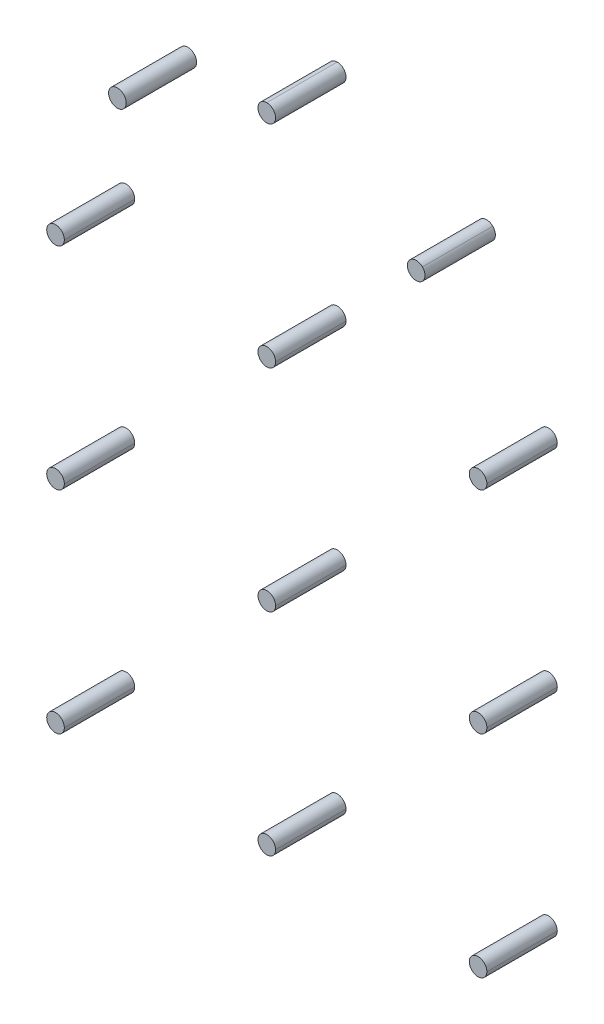
ISO-10303-21;
HEADER;
FILE_DESCRIPTION(('STEP AP214'),'2;1');
FILE_NAME('part.step','',(''),(''),'','','');
FILE_SCHEMA(('AUTOMOTIVE_DESIGN { 1 0 10303 214 1 1 1 1 }'));
ENDSEC;
DATA;
#1=APPLICATION_CONTEXT('core data for automotive mechanical design processes');
#2=APPLICATION_PROTOCOL_DEFINITION('international standard','automotive_design',2000,#1);
#3=PRODUCT_CONTEXT('',#1,'mechanical');
#4=PRODUCT('Part','Part','',(#3));
#5=PRODUCT_RELATED_PRODUCT_CATEGORY('part','',(#4));
#6=PRODUCT_DEFINITION_FORMATION('','',#4);
#7=PRODUCT_DEFINITION_CONTEXT('part definition',#1,'design');
#8=PRODUCT_DEFINITION('design','',#6,#7);
#9=PRODUCT_DEFINITION_SHAPE('','',#8);
#10=(LENGTH_UNIT() NAMED_UNIT(*) SI_UNIT(.MILLI.,.METRE.));
#11=(NAMED_UNIT(*) PLANE_ANGLE_UNIT() SI_UNIT($,.RADIAN.));
#12=(NAMED_UNIT(*) SI_UNIT($,.STERADIAN.) SOLID_ANGLE_UNIT());
#13=UNCERTAINTY_MEASURE_WITH_UNIT(LENGTH_MEASURE(1.E-05),#10,'distance_accuracy_value','');
#14=(GEOMETRIC_REPRESENTATION_CONTEXT(3) GLOBAL_UNCERTAINTY_ASSIGNED_CONTEXT((#13)) GLOBAL_UNIT_ASSIGNED_CONTEXT((#10,
#11,#12)) REPRESENTATION_CONTEXT('',''));
#15=CARTESIAN_POINT('',(0.,0.,0.));
#16=DIRECTION('',(0.,0.,1.));
#17=DIRECTION('',(1.,0.,0.));
#18=AXIS2_PLACEMENT_3D('',#15,#16,#17);
#19=CARTESIAN_POINT('',(0.,0.,1.));
#20=DIRECTION('',(0.,0.,1.));
#21=DIRECTION('',(1.,0.,0.));
#22=AXIS2_PLACEMENT_3D('',#19,#20,#21);
#23=PLANE('',#22);
#24=CARTESIAN_POINT('',(-6.,0.,1.));
#25=DIRECTION('',(0.,0.,1.));
#26=DIRECTION('',(1.,0.,0.));
#27=AXIS2_PLACEMENT_3D('',#24,#25,#26);
#28=CIRCLE('',#27,0.25);
#29=CARTESIAN_POINT('',(-6.25,0.,1.));
#30=VERTEX_POINT('',#29);
#31=CARTESIAN_POINT('',(-5.75,0.,1.));
#32=VERTEX_POINT('',#31);
#33=EDGE_CURVE('P0_E57',#30,#32,#28,.T.);
#34=ORIENTED_EDGE('',*,*,#33,.T.);
#35=CARTESIAN_POINT('',(-6.,0.,1.));
#36=DIRECTION('',(0.,0.,1.));
#37=DIRECTION('',(1.,0.,0.));
#38=AXIS2_PLACEMENT_3D('',#35,#36,#37);
#39=CIRCLE('',#38,0.25);
#40=EDGE_CURVE('P0_E11',#32,#30,#39,.T.);
#41=ORIENTED_EDGE('',*,*,#40,.T.);
#42=EDGE_LOOP('',(#34,#41));
#43=FACE_BOUND('',#42,.T.);
#44=ADVANCED_FACE('P0_F17',(#43),#23,.T.);
#45=CARTESIAN_POINT('',(0.,0.,-1.));
#46=DIRECTION('',(0.,0.,1.));
#47=DIRECTION('',(1.,0.,0.));
#48=AXIS2_PLACEMENT_3D('',#45,#46,#47);
#49=PLANE('',#48);
#50=CARTESIAN_POINT('',(-6.,0.,-1.));
#51=DIRECTION('',(0.,0.,1.));
#52=DIRECTION('',(1.,0.,0.));
#53=AXIS2_PLACEMENT_3D('',#50,#51,#52);
#54=CIRCLE('',#53,0.25);
#55=CARTESIAN_POINT('',(-5.75,0.,-1.));
#56=VERTEX_POINT('',#55);
#57=CARTESIAN_POINT('',(-6.25,0.,-1.));
#58=VERTEX_POINT('',#57);
#59=EDGE_CURVE('P0_E21',#56,#58,#54,.T.);
#60=ORIENTED_EDGE('',*,*,#59,.F.);
#61=CARTESIAN_POINT('',(-6.,0.,-1.));
#62=DIRECTION('',(0.,0.,1.));
#63=DIRECTION('',(1.,0.,0.));
#64=AXIS2_PLACEMENT_3D('',#61,#62,#63);
#65=CIRCLE('',#64,0.25);
#66=EDGE_CURVE('P0_E58',#58,#56,#65,.T.);
#67=ORIENTED_EDGE('',*,*,#66,.F.);
#68=EDGE_LOOP('',(#60,#67));
#69=FACE_BOUND('',#68,.T.);
#70=ADVANCED_FACE('P0_F19',(#69),#49,.F.);
#71=CARTESIAN_POINT('',(-6.,0.,0.));
#72=DIRECTION('',(0.,0.,1.));
#73=DIRECTION('',(-1.,0.,0.));
#74=AXIS2_PLACEMENT_3D('',#71,#72,#73);
#75=CYLINDRICAL_SURFACE('',#74,0.25);
#76=DIRECTION('',(0.,0.,1.));
#77=VECTOR('',#76,1.);
#78=CARTESIAN_POINT('',(-5.75,0.,0.));
#79=LINE('',#78,#77);
#80=EDGE_CURVE('P0_E53',#56,#32,#79,.T.);
#81=ORIENTED_EDGE('',*,*,#80,.F.);
#82=ORIENTED_EDGE('',*,*,#59,.T.);
#83=DIRECTION('',(0.,0.,1.));
#84=VECTOR('',#83,1.);
#85=CARTESIAN_POINT('',(-6.25,0.,0.));
#86=LINE('',#85,#84);
#87=EDGE_CURVE('P0_E51',#58,#30,#86,.T.);
#88=ORIENTED_EDGE('',*,*,#87,.T.);
#89=ORIENTED_EDGE('',*,*,#40,.F.);
#90=EDGE_LOOP('',(#81,#82,#88,#89));
#91=FACE_BOUND('',#90,.T.);
#92=ADVANCED_FACE('P0_F49',(#91),#75,.T.);
#93=CARTESIAN_POINT('',(-6.,0.,0.));
#94=DIRECTION('',(0.,0.,1.));
#95=DIRECTION('',(-1.,0.,0.));
#96=AXIS2_PLACEMENT_3D('',#93,#94,#95);
#97=CYLINDRICAL_SURFACE('',#96,0.25);
#98=ORIENTED_EDGE('',*,*,#87,.F.);
#99=ORIENTED_EDGE('',*,*,#66,.T.);
#100=ORIENTED_EDGE('',*,*,#80,.T.);
#101=ORIENTED_EDGE('',*,*,#33,.F.);
#102=EDGE_LOOP('',(#98,#99,#100,#101));
#103=FACE_BOUND('',#102,.T.);
#104=ADVANCED_FACE('P0_F63',(#103),#97,.T.);
#105=CLOSED_SHELL('',(#44,#70,#92,#104));
#106=MANIFOLD_SOLID_BREP('P0_B1',#105);
#107=CARTESIAN_POINT('',(0.,0.,1.));
#108=DIRECTION('',(0.,0.,1.));
#109=DIRECTION('',(1.,0.,0.));
#110=AXIS2_PLACEMENT_3D('',#107,#108,#109);
#111=PLANE('',#110);
#112=CARTESIAN_POINT('',(-6.,-6.,1.));
#113=DIRECTION('',(0.,0.,1.));
#114=DIRECTION('',(1.,0.,0.));
#115=AXIS2_PLACEMENT_3D('',#112,#113,#114);
#116=CIRCLE('',#115,0.25);
#117=CARTESIAN_POINT('',(-6.25,-6.,1.));
#118=VERTEX_POINT('',#117);
#119=CARTESIAN_POINT('',(-5.75,-6.,1.));
#120=VERTEX_POINT('',#119);
#121=EDGE_CURVE('P1_E60',#118,#120,#116,.T.);
#122=ORIENTED_EDGE('',*,*,#121,.T.);
#123=CARTESIAN_POINT('',(-6.,-6.,1.));
#124=DIRECTION('',(0.,0.,1.));
#125=DIRECTION('',(1.,0.,0.));
#126=AXIS2_PLACEMENT_3D('',#123,#124,#125);
#127=CIRCLE('',#126,0.25);
#128=EDGE_CURVE('P1_E11',#120,#118,#127,.T.);
#129=ORIENTED_EDGE('',*,*,#128,.T.);
#130=EDGE_LOOP('',(#122,#129));
#131=FACE_BOUND('',#130,.T.);
#132=ADVANCED_FACE('P1_F17',(#131),#111,.T.);
#133=CARTESIAN_POINT('',(0.,0.,-1.));
#134=DIRECTION('',(0.,0.,1.));
#135=DIRECTION('',(1.,0.,0.));
#136=AXIS2_PLACEMENT_3D('',#133,#134,#135);
#137=PLANE('',#136);
#138=CARTESIAN_POINT('',(-6.,-6.,-1.));
#139=DIRECTION('',(0.,0.,1.));
#140=DIRECTION('',(1.,0.,0.));
#141=AXIS2_PLACEMENT_3D('',#138,#139,#140);
#142=CIRCLE('',#141,0.25);
#143=CARTESIAN_POINT('',(-5.75,-6.,-1.));
#144=VERTEX_POINT('',#143);
#145=CARTESIAN_POINT('',(-6.25,-6.,-1.));
#146=VERTEX_POINT('',#145);
#147=EDGE_CURVE('P1_E27',#144,#146,#142,.T.);
#148=ORIENTED_EDGE('',*,*,#147,.F.);
#149=CARTESIAN_POINT('',(-6.,-6.,-1.));
#150=DIRECTION('',(0.,0.,1.));
#151=DIRECTION('',(1.,0.,0.));
#152=AXIS2_PLACEMENT_3D('',#149,#150,#151);
#153=CIRCLE('',#152,0.25);
#154=EDGE_CURVE('P1_E61',#146,#144,#153,.T.);
#155=ORIENTED_EDGE('',*,*,#154,.F.);
#156=EDGE_LOOP('',(#148,#155));
#157=FACE_BOUND('',#156,.T.);
#158=ADVANCED_FACE('P1_F62',(#157),#137,.F.);
#159=CARTESIAN_POINT('',(-6.,-6.,0.));
#160=DIRECTION('',(0.,0.,1.));
#161=DIRECTION('',(-1.,0.,0.));
#162=AXIS2_PLACEMENT_3D('',#159,#160,#161);
#163=CYLINDRICAL_SURFACE('',#162,0.25);
#164=DIRECTION('',(0.,0.,1.));
#165=VECTOR('',#164,1.);
#166=CARTESIAN_POINT('',(-5.75,-6.,0.));
#167=LINE('',#166,#165);
#168=EDGE_CURVE('P1_E56',#144,#120,#167,.T.);
#169=ORIENTED_EDGE('',*,*,#168,.F.);
#170=ORIENTED_EDGE('',*,*,#147,.T.);
#171=DIRECTION('',(0.,0.,1.));
#172=VECTOR('',#171,1.);
#173=CARTESIAN_POINT('',(-6.25,-6.,0.));
#174=LINE('',#173,#172);
#175=EDGE_CURVE('P1_E20',#146,#118,#174,.T.);
#176=ORIENTED_EDGE('',*,*,#175,.T.);
#177=ORIENTED_EDGE('',*,*,#128,.F.);
#178=EDGE_LOOP('',(#169,#170,#176,#177));
#179=FACE_BOUND('',#178,.T.);
#180=ADVANCED_FACE('P1_F53',(#179),#163,.T.);
#181=CARTESIAN_POINT('',(-6.,-6.,0.));
#182=DIRECTION('',(0.,0.,1.));
#183=DIRECTION('',(-1.,0.,0.));
#184=AXIS2_PLACEMENT_3D('',#181,#182,#183);
#185=CYLINDRICAL_SURFACE('',#184,0.25);
#186=ORIENTED_EDGE('',*,*,#175,.F.);
#187=ORIENTED_EDGE('',*,*,#154,.T.);
#188=ORIENTED_EDGE('',*,*,#168,.T.);
#189=ORIENTED_EDGE('',*,*,#121,.F.);
#190=EDGE_LOOP('',(#186,#187,#188,#189));
#191=FACE_BOUND('',#190,.T.);
#192=ADVANCED_FACE('P1_F66',(#191),#185,.T.);
#193=CLOSED_SHELL('',(#132,#158,#180,#192));
#194=MANIFOLD_SOLID_BREP('P1_B1',#193);
#195=CARTESIAN_POINT('',(0.,0.,1.));
#196=DIRECTION('',(0.,0.,1.));
#197=DIRECTION('',(1.,0.,0.));
#198=AXIS2_PLACEMENT_3D('',#195,#196,#197);
#199=PLANE('',#198);
#200=CARTESIAN_POINT('',(6.,-6.,1.));
#201=DIRECTION('',(0.,0.,1.));
#202=DIRECTION('',(1.,0.,0.));
#203=AXIS2_PLACEMENT_3D('',#200,#201,#202);
#204=CIRCLE('',#203,0.25);
#205=CARTESIAN_POINT('',(5.75,-6.,1.));
#206=VERTEX_POINT('',#205);
#207=CARTESIAN_POINT('',(6.25,-6.,1.));
#208=VERTEX_POINT('',#207);
#209=EDGE_CURVE('P2_E57',#206,#208,#204,.T.);
#210=ORIENTED_EDGE('',*,*,#209,.T.);
#211=CARTESIAN_POINT('',(6.,-6.,1.));
#212=DIRECTION('',(0.,0.,1.));
#213=DIRECTION('',(1.,0.,0.));
#214=AXIS2_PLACEMENT_3D('',#211,#212,#213);
#215=CIRCLE('',#214,0.25);
#216=EDGE_CURVE('P2_E11',#208,#206,#215,.T.);
#217=ORIENTED_EDGE('',*,*,#216,.T.);
#218=EDGE_LOOP('',(#210,#217));
#219=FACE_BOUND('',#218,.T.);
#220=ADVANCED_FACE('P2_F17',(#219),#199,.T.);
#221=CARTESIAN_POINT('',(0.,0.,-1.));
#222=DIRECTION('',(0.,0.,1.));
#223=DIRECTION('',(1.,0.,0.));
#224=AXIS2_PLACEMENT_3D('',#221,#222,#223);
#225=PLANE('',#224);
#226=CARTESIAN_POINT('',(6.,-6.,-1.));
#227=DIRECTION('',(0.,0.,1.));
#228=DIRECTION('',(1.,0.,0.));
#229=AXIS2_PLACEMENT_3D('',#226,#227,#228);
#230=CIRCLE('',#229,0.25);
#231=CARTESIAN_POINT('',(6.25,-6.,-1.));
#232=VERTEX_POINT('',#231);
#233=CARTESIAN_POINT('',(5.75,-6.,-1.));
#234=VERTEX_POINT('',#233);
#235=EDGE_CURVE('P2_E27',#232,#234,#230,.T.);
#236=ORIENTED_EDGE('',*,*,#235,.F.);
#237=CARTESIAN_POINT('',(6.,-6.,-1.));
#238=DIRECTION('',(0.,0.,1.));
#239=DIRECTION('',(1.,0.,0.));
#240=AXIS2_PLACEMENT_3D('',#237,#238,#239);
#241=CIRCLE('',#240,0.25);
#242=EDGE_CURVE('P2_E59',#234,#232,#241,.T.);
#243=ORIENTED_EDGE('',*,*,#242,.F.);
#244=EDGE_LOOP('',(#236,#243));
#245=FACE_BOUND('',#244,.T.);
#246=ADVANCED_FACE('P2_F60',(#245),#225,.F.);
#247=CARTESIAN_POINT('',(6.,-6.,0.));
#248=DIRECTION('',(0.,0.,1.));
#249=DIRECTION('',(-1.,0.,0.));
#250=AXIS2_PLACEMENT_3D('',#247,#248,#249);
#251=CYLINDRICAL_SURFACE('',#250,0.25);
#252=DIRECTION('',(0.,0.,1.));
#253=VECTOR('',#252,1.);
#254=CARTESIAN_POINT('',(6.25,-6.,0.));
#255=LINE('',#254,#253);
#256=EDGE_CURVE('P2_E21',#232,#208,#255,.T.);
#257=ORIENTED_EDGE('',*,*,#256,.F.);
#258=ORIENTED_EDGE('',*,*,#235,.T.);
#259=DIRECTION('',(0.,0.,1.));
#260=VECTOR('',#259,1.);
#261=CARTESIAN_POINT('',(5.75,-6.,0.));
#262=LINE('',#261,#260);
#263=EDGE_CURVE('P2_E53',#234,#206,#262,.T.);
#264=ORIENTED_EDGE('',*,*,#263,.T.);
#265=ORIENTED_EDGE('',*,*,#216,.F.);
#266=EDGE_LOOP('',(#257,#258,#264,#265));
#267=FACE_BOUND('',#266,.T.);
#268=ADVANCED_FACE('P2_F19',(#267),#251,.T.);
#269=CARTESIAN_POINT('',(6.,-6.,0.));
#270=DIRECTION('',(0.,0.,1.));
#271=DIRECTION('',(-1.,0.,0.));
#272=AXIS2_PLACEMENT_3D('',#269,#270,#271);
#273=CYLINDRICAL_SURFACE('',#272,0.25);
#274=ORIENTED_EDGE('',*,*,#263,.F.);
#275=ORIENTED_EDGE('',*,*,#242,.T.);
#276=ORIENTED_EDGE('',*,*,#256,.T.);
#277=ORIENTED_EDGE('',*,*,#209,.F.);
#278=EDGE_LOOP('',(#274,#275,#276,#277));
#279=FACE_BOUND('',#278,.T.);
#280=ADVANCED_FACE('P2_F65',(#279),#273,.T.);
#281=CLOSED_SHELL('',(#220,#246,#268,#280));
#282=MANIFOLD_SOLID_BREP('P2_B1',#281);
#283=CARTESIAN_POINT('',(0.,0.,1.));
#284=DIRECTION('',(0.,0.,1.));
#285=DIRECTION('',(1.,0.,0.));
#286=AXIS2_PLACEMENT_3D('',#283,#284,#285);
#287=PLANE('',#286);
#288=CARTESIAN_POINT('',(6.,-12.,1.));
#289=DIRECTION('',(0.,0.,1.));
#290=DIRECTION('',(1.,0.,0.));
#291=AXIS2_PLACEMENT_3D('',#288,#289,#290);
#292=CIRCLE('',#291,0.25);
#293=CARTESIAN_POINT('',(5.75,-12.,1.));
#294=VERTEX_POINT('',#293);
#295=CARTESIAN_POINT('',(6.25,-12.,1.));
#296=VERTEX_POINT('',#295);
#297=EDGE_CURVE('P3_E51',#294,#296,#292,.T.);
#298=ORIENTED_EDGE('',*,*,#297,.T.);
#299=CARTESIAN_POINT('',(6.,-12.,1.));
#300=DIRECTION('',(0.,0.,1.));
#301=DIRECTION('',(1.,0.,0.));
#302=AXIS2_PLACEMENT_3D('',#299,#300,#301);
#303=CIRCLE('',#302,0.25);
#304=EDGE_CURVE('P3_E11',#296,#294,#303,.T.);
#305=ORIENTED_EDGE('',*,*,#304,.T.);
#306=EDGE_LOOP('',(#298,#305));
#307=FACE_BOUND('',#306,.T.);
#308=ADVANCED_FACE('P3_F17',(#307),#287,.T.);
#309=CARTESIAN_POINT('',(0.,0.,-1.));
#310=DIRECTION('',(0.,0.,1.));
#311=DIRECTION('',(1.,0.,0.));
#312=AXIS2_PLACEMENT_3D('',#309,#310,#311);
#313=PLANE('',#312);
#314=CARTESIAN_POINT('',(6.,-12.,-1.));
#315=DIRECTION('',(0.,0.,1.));
#316=DIRECTION('',(1.,0.,0.));
#317=AXIS2_PLACEMENT_3D('',#314,#315,#316);
#318=CIRCLE('',#317,0.25);
#319=CARTESIAN_POINT('',(6.25,-12.,-1.));
#320=VERTEX_POINT('',#319);
#321=CARTESIAN_POINT('',(5.75,-12.,-1.));
#322=VERTEX_POINT('',#321);
#323=EDGE_CURVE('P3_E27',#320,#322,#318,.T.);
#324=ORIENTED_EDGE('',*,*,#323,.F.);
#325=CARTESIAN_POINT('',(6.,-12.,-1.));
#326=DIRECTION('',(0.,0.,1.));
#327=DIRECTION('',(1.,0.,0.));
#328=AXIS2_PLACEMENT_3D('',#325,#326,#327);
#329=CIRCLE('',#328,0.25);
#330=EDGE_CURVE('P3_E62',#322,#320,#329,.T.);
#331=ORIENTED_EDGE('',*,*,#330,.F.);
#332=EDGE_LOOP('',(#324,#331));
#333=FACE_BOUND('',#332,.T.);
#334=ADVANCED_FACE('P3_F108',(#333),#313,.F.);
#335=CARTESIAN_POINT('',(6.,-12.,0.));
#336=DIRECTION('',(0.,0.,1.));
#337=DIRECTION('',(-1.,0.,0.));
#338=AXIS2_PLACEMENT_3D('',#335,#336,#337);
#339=CYLINDRICAL_SURFACE('',#338,0.25);
#340=DIRECTION('',(0.,0.,1.));
#341=VECTOR('',#340,1.);
#342=CARTESIAN_POINT('',(6.25,-12.,0.));
#343=LINE('',#342,#341);
#344=EDGE_CURVE('P3_E58',#320,#296,#343,.T.);
#345=ORIENTED_EDGE('',*,*,#344,.F.);
#346=ORIENTED_EDGE('',*,*,#323,.T.);
#347=DIRECTION('',(0.,0.,1.));
#348=VECTOR('',#347,1.);
#349=CARTESIAN_POINT('',(5.75,-12.,0.));
#350=LINE('',#349,#348);
#351=EDGE_CURVE('P3_E57',#322,#294,#350,.T.);
#352=ORIENTED_EDGE('',*,*,#351,.T.);
#353=ORIENTED_EDGE('',*,*,#304,.F.);
#354=EDGE_LOOP('',(#345,#346,#352,#353));
#355=FACE_BOUND('',#354,.T.);
#356=ADVANCED_FACE('P3_F19',(#355),#339,.T.);
#357=CARTESIAN_POINT('',(6.,-12.,0.));
#358=DIRECTION('',(0.,0.,1.));
#359=DIRECTION('',(-1.,0.,0.));
#360=AXIS2_PLACEMENT_3D('',#357,#358,#359);
#361=CYLINDRICAL_SURFACE('',#360,0.25);
#362=ORIENTED_EDGE('',*,*,#351,.F.);
#363=ORIENTED_EDGE('',*,*,#330,.T.);
#364=ORIENTED_EDGE('',*,*,#344,.T.);
#365=ORIENTED_EDGE('',*,*,#297,.F.);
#366=EDGE_LOOP('',(#362,#363,#364,#365));
#367=FACE_BOUND('',#366,.T.);
#368=ADVANCED_FACE('P3_F55',(#367),#361,.T.);
#369=CLOSED_SHELL('',(#308,#334,#356,#368));
#370=MANIFOLD_SOLID_BREP('P3_B1',#369);
#371=CARTESIAN_POINT('',(0.,0.,1.));
#372=DIRECTION('',(0.,0.,1.));
#373=DIRECTION('',(1.,0.,0.));
#374=AXIS2_PLACEMENT_3D('',#371,#372,#373);
#375=PLANE('',#374);
#376=CARTESIAN_POINT('',(-4.24264068712,4.24264068712,1.));
#377=DIRECTION('',(0.,0.,1.));
#378=DIRECTION('',(1.,0.,0.));
#379=AXIS2_PLACEMENT_3D('',#376,#377,#378);
#380=CIRCLE('',#379,0.25);
#381=CARTESIAN_POINT('',(-4.41941738242,4.41941738242,1.));
#382=VERTEX_POINT('',#381);
#383=CARTESIAN_POINT('',(-4.06586399182,4.06586399182,1.));
#384=VERTEX_POINT('',#383);
#385=EDGE_CURVE('P4_E49',#382,#384,#380,.T.);
#386=ORIENTED_EDGE('',*,*,#385,.T.);
#387=CARTESIAN_POINT('',(-4.24264068712,4.24264068712,1.));
#388=DIRECTION('',(0.,0.,1.));
#389=DIRECTION('',(1.,0.,0.));
#390=AXIS2_PLACEMENT_3D('',#387,#388,#389);
#391=CIRCLE('',#390,0.25);
#392=EDGE_CURVE('P4_E11',#384,#382,#391,.T.);
#393=ORIENTED_EDGE('',*,*,#392,.T.);
#394=EDGE_LOOP('',(#386,#393));
#395=FACE_BOUND('',#394,.T.);
#396=ADVANCED_FACE('P4_F17',(#395),#375,.T.);
#397=CARTESIAN_POINT('',(0.,0.,-1.));
#398=DIRECTION('',(0.,0.,1.));
#399=DIRECTION('',(1.,0.,0.));
#400=AXIS2_PLACEMENT_3D('',#397,#398,#399);
#401=PLANE('',#400);
#402=CARTESIAN_POINT('',(-4.24264068712,4.24264068712,-1.));
#403=DIRECTION('',(0.,0.,1.));
#404=DIRECTION('',(1.,0.,0.));
#405=AXIS2_PLACEMENT_3D('',#402,#403,#404);
#406=CIRCLE('',#405,0.25);
#407=CARTESIAN_POINT('',(-4.06586399182,4.06586399182,-1.));
#408=VERTEX_POINT('',#407);
#409=CARTESIAN_POINT('',(-4.41941738242,4.41941738242,-1.));
#410=VERTEX_POINT('',#409);
#411=EDGE_CURVE('P4_E27',#408,#410,#406,.T.);
#412=ORIENTED_EDGE('',*,*,#411,.F.);
#413=CARTESIAN_POINT('',(-4.24264068712,4.24264068712,-1.));
#414=DIRECTION('',(0.,0.,1.));
#415=DIRECTION('',(1.,0.,0.));
#416=AXIS2_PLACEMENT_3D('',#413,#414,#415);
#417=CIRCLE('',#416,0.25);
#418=EDGE_CURVE('P4_E61',#410,#408,#417,.T.);
#419=ORIENTED_EDGE('',*,*,#418,.F.);
#420=EDGE_LOOP('',(#412,#419));
#421=FACE_BOUND('',#420,.T.);
#422=ADVANCED_FACE('P4_F105',(#421),#401,.F.);
#423=CARTESIAN_POINT('',(-4.24264068712,4.24264068712,0.));
#424=DIRECTION('',(0.,0.,1.));
#425=DIRECTION('',(-0.707106781186548,0.707106781186548,0.));
#426=AXIS2_PLACEMENT_3D('',#423,#424,#425);
#427=CYLINDRICAL_SURFACE('',#426,0.25);
#428=DIRECTION('',(0.,0.,1.));
#429=VECTOR('',#428,1.);
#430=CARTESIAN_POINT('',(-4.06586399182,4.06586399182,0.));
#431=LINE('',#430,#429);
#432=EDGE_CURVE('P4_E56',#408,#384,#431,.T.);
#433=ORIENTED_EDGE('',*,*,#432,.F.);
#434=ORIENTED_EDGE('',*,*,#411,.T.);
#435=DIRECTION('',(0.,0.,1.));
#436=VECTOR('',#435,1.);
#437=CARTESIAN_POINT('',(-4.41941738242,4.41941738242,0.));
#438=LINE('',#437,#436);
#439=EDGE_CURVE('P4_E55',#410,#382,#438,.T.);
#440=ORIENTED_EDGE('',*,*,#439,.T.);
#441=ORIENTED_EDGE('',*,*,#392,.F.);
#442=EDGE_LOOP('',(#433,#434,#440,#441));
#443=FACE_BOUND('',#442,.T.);
#444=ADVANCED_FACE('P4_F19',(#443),#427,.T.);
#445=CARTESIAN_POINT('',(-4.24264068712,4.24264068712,0.));
#446=DIRECTION('',(0.,0.,1.));
#447=DIRECTION('',(-0.707106781186548,0.707106781186548,0.));
#448=AXIS2_PLACEMENT_3D('',#445,#446,#447);
#449=CYLINDRICAL_SURFACE('',#448,0.25);
#450=ORIENTED_EDGE('',*,*,#439,.F.);
#451=ORIENTED_EDGE('',*,*,#418,.T.);
#452=ORIENTED_EDGE('',*,*,#432,.T.);
#453=ORIENTED_EDGE('',*,*,#385,.F.);
#454=EDGE_LOOP('',(#450,#451,#452,#453));
#455=FACE_BOUND('',#454,.T.);
#456=ADVANCED_FACE('P4_F53',(#455),#449,.T.);
#457=CLOSED_SHELL('',(#396,#422,#444,#456));
#458=MANIFOLD_SOLID_BREP('P4_B1',#457);
#459=CARTESIAN_POINT('',(0.,0.,1.));
#460=DIRECTION('',(0.,0.,1.));
#461=DIRECTION('',(1.,0.,0.));
#462=AXIS2_PLACEMENT_3D('',#459,#460,#461);
#463=PLANE('',#462);
#464=CARTESIAN_POINT('',(0.,6.,1.));
#465=DIRECTION('',(0.,0.,1.));
#466=DIRECTION('',(1.,0.,0.));
#467=AXIS2_PLACEMENT_3D('',#464,#465,#466);
#468=CIRCLE('',#467,0.25);
#469=CARTESIAN_POINT('',(0.,6.25,1.));
#470=VERTEX_POINT('',#469);
#471=CARTESIAN_POINT('',(0.,5.75,1.));
#472=VERTEX_POINT('',#471);
#473=EDGE_CURVE('P5_E58',#470,#472,#468,.T.);
#474=ORIENTED_EDGE('',*,*,#473,.T.);
#475=CARTESIAN_POINT('',(0.,6.,1.));
#476=DIRECTION('',(0.,0.,1.));
#477=DIRECTION('',(1.,0.,0.));
#478=AXIS2_PLACEMENT_3D('',#475,#476,#477);
#479=CIRCLE('',#478,0.25);
#480=EDGE_CURVE('P5_E11',#472,#470,#479,.T.);
#481=ORIENTED_EDGE('',*,*,#480,.T.);
#482=EDGE_LOOP('',(#474,#481));
#483=FACE_BOUND('',#482,.T.);
#484=ADVANCED_FACE('P5_F17',(#483),#463,.T.);
#485=CARTESIAN_POINT('',(0.,0.,-1.));
#486=DIRECTION('',(0.,0.,1.));
#487=DIRECTION('',(1.,0.,0.));
#488=AXIS2_PLACEMENT_3D('',#485,#486,#487);
#489=PLANE('',#488);
#490=CARTESIAN_POINT('',(0.,6.,-1.));
#491=DIRECTION('',(0.,0.,1.));
#492=DIRECTION('',(1.,0.,0.));
#493=AXIS2_PLACEMENT_3D('',#490,#491,#492);
#494=CIRCLE('',#493,0.25);
#495=CARTESIAN_POINT('',(0.,5.75,-1.));
#496=VERTEX_POINT('',#495);
#497=CARTESIAN_POINT('',(0.,6.25,-1.));
#498=VERTEX_POINT('',#497);
#499=EDGE_CURVE('P5_E27',#496,#498,#494,.T.);
#500=ORIENTED_EDGE('',*,*,#499,.F.);
#501=CARTESIAN_POINT('',(0.,6.,-1.));
#502=DIRECTION('',(0.,0.,1.));
#503=DIRECTION('',(1.,0.,0.));
#504=AXIS2_PLACEMENT_3D('',#501,#502,#503);
#505=CIRCLE('',#504,0.25);
#506=EDGE_CURVE('P5_E21',#498,#496,#505,.T.);
#507=ORIENTED_EDGE('',*,*,#506,.F.);
#508=EDGE_LOOP('',(#500,#507));
#509=FACE_BOUND('',#508,.T.);
#510=ADVANCED_FACE('P5_F60',(#509),#489,.F.);
#511=CARTESIAN_POINT('',(0.,6.,0.));
#512=DIRECTION('',(0.,0.,1.));
#513=DIRECTION('',(0.,1.,0.));
#514=AXIS2_PLACEMENT_3D('',#511,#512,#513);
#515=CYLINDRICAL_SURFACE('',#514,0.25);
#516=DIRECTION('',(0.,0.,1.));
#517=VECTOR('',#516,1.);
#518=CARTESIAN_POINT('',(0.,5.75,0.));
#519=LINE('',#518,#517);
#520=EDGE_CURVE('P5_E55',#496,#472,#519,.T.);
#521=ORIENTED_EDGE('',*,*,#520,.F.);
#522=ORIENTED_EDGE('',*,*,#499,.T.);
#523=DIRECTION('',(0.,0.,1.));
#524=VECTOR('',#523,1.);
#525=CARTESIAN_POINT('',(0.,6.25,0.));
#526=LINE('',#525,#524);
#527=EDGE_CURVE('P5_E53',#498,#470,#526,.T.);
#528=ORIENTED_EDGE('',*,*,#527,.T.);
#529=ORIENTED_EDGE('',*,*,#480,.F.);
#530=EDGE_LOOP('',(#521,#522,#528,#529));
#531=FACE_BOUND('',#530,.T.);
#532=ADVANCED_FACE('P5_F19',(#531),#515,.T.);
#533=CARTESIAN_POINT('',(0.,6.,0.));
#534=DIRECTION('',(0.,0.,1.));
#535=DIRECTION('',(0.,1.,0.));
#536=AXIS2_PLACEMENT_3D('',#533,#534,#535);
#537=CYLINDRICAL_SURFACE('',#536,0.25);
#538=ORIENTED_EDGE('',*,*,#527,.F.);
#539=ORIENTED_EDGE('',*,*,#506,.T.);
#540=ORIENTED_EDGE('',*,*,#520,.T.);
#541=ORIENTED_EDGE('',*,*,#473,.F.);
#542=EDGE_LOOP('',(#538,#539,#540,#541));
#543=FACE_BOUND('',#542,.T.);
#544=ADVANCED_FACE('P5_F64',(#543),#537,.T.);
#545=CLOSED_SHELL('',(#484,#510,#532,#544));
#546=MANIFOLD_SOLID_BREP('P5_B1',#545);
#547=CARTESIAN_POINT('',(0.,0.,1.));
#548=DIRECTION('',(0.,0.,1.));
#549=DIRECTION('',(1.,0.,0.));
#550=AXIS2_PLACEMENT_3D('',#547,#548,#549);
#551=PLANE('',#550);
#552=CARTESIAN_POINT('',(4.24264068712,4.24264068712,1.));
#553=DIRECTION('',(0.,0.,1.));
#554=DIRECTION('',(1.,0.,0.));
#555=AXIS2_PLACEMENT_3D('',#552,#553,#554);
#556=CIRCLE('',#555,0.25);
#557=CARTESIAN_POINT('',(4.41941738242,4.41941738242,1.));
#558=VERTEX_POINT('',#557);
#559=CARTESIAN_POINT('',(4.06586399182,4.06586399182,1.));
#560=VERTEX_POINT('',#559);
#561=EDGE_CURVE('P6_E59',#558,#560,#556,.T.);
#562=ORIENTED_EDGE('',*,*,#561,.T.);
#563=CARTESIAN_POINT('',(4.24264068712,4.24264068712,1.));
#564=DIRECTION('',(0.,0.,1.));
#565=DIRECTION('',(1.,0.,0.));
#566=AXIS2_PLACEMENT_3D('',#563,#564,#565);
#567=CIRCLE('',#566,0.25);
#568=EDGE_CURVE('P6_E11',#560,#558,#567,.T.);
#569=ORIENTED_EDGE('',*,*,#568,.T.);
#570=EDGE_LOOP('',(#562,#569));
#571=FACE_BOUND('',#570,.T.);
#572=ADVANCED_FACE('P6_F17',(#571),#551,.T.);
#573=CARTESIAN_POINT('',(0.,0.,-1.));
#574=DIRECTION('',(0.,0.,1.));
#575=DIRECTION('',(1.,0.,0.));
#576=AXIS2_PLACEMENT_3D('',#573,#574,#575);
#577=PLANE('',#576);
#578=CARTESIAN_POINT('',(4.24264068712,4.24264068712,-1.));
#579=DIRECTION('',(0.,0.,1.));
#580=DIRECTION('',(1.,0.,0.));
#581=AXIS2_PLACEMENT_3D('',#578,#579,#580);
#582=CIRCLE('',#581,0.25);
#583=CARTESIAN_POINT('',(4.06586399182,4.06586399182,-1.));
#584=VERTEX_POINT('',#583);
#585=CARTESIAN_POINT('',(4.41941738242,4.41941738242,-1.));
#586=VERTEX_POINT('',#585);
#587=EDGE_CURVE('P6_E27',#584,#586,#582,.T.);
#588=ORIENTED_EDGE('',*,*,#587,.F.);
#589=CARTESIAN_POINT('',(4.24264068712,4.24264068712,-1.));
#590=DIRECTION('',(0.,0.,1.));
#591=DIRECTION('',(1.,0.,0.));
#592=AXIS2_PLACEMENT_3D('',#589,#590,#591);
#593=CIRCLE('',#592,0.25);
#594=EDGE_CURVE('P6_E61',#586,#584,#593,.T.);
#595=ORIENTED_EDGE('',*,*,#594,.F.);
#596=EDGE_LOOP('',(#588,#595));
#597=FACE_BOUND('',#596,.T.);
#598=ADVANCED_FACE('P6_F19',(#597),#577,.F.);
#599=CARTESIAN_POINT('',(4.24264068712,4.24264068712,0.));
#600=DIRECTION('',(0.,0.,1.));
#601=DIRECTION('',(0.707106781186548,0.707106781186548,0.));
#602=AXIS2_PLACEMENT_3D('',#599,#600,#601);
#603=CYLINDRICAL_SURFACE('',#602,0.25);
#604=DIRECTION('',(0.,0.,1.));
#605=VECTOR('',#604,1.);
#606=CARTESIAN_POINT('',(4.06586399182,4.06586399182,0.));
#607=LINE('',#606,#605);
#608=EDGE_CURVE('P6_E56',#584,#560,#607,.T.);
#609=ORIENTED_EDGE('',*,*,#608,.F.);
#610=ORIENTED_EDGE('',*,*,#587,.T.);
#611=DIRECTION('',(0.,0.,1.));
#612=VECTOR('',#611,1.);
#613=CARTESIAN_POINT('',(4.41941738242,4.41941738242,0.));
#614=LINE('',#613,#612);
#615=EDGE_CURVE('P6_E21',#586,#558,#614,.T.);
#616=ORIENTED_EDGE('',*,*,#615,.T.);
#617=ORIENTED_EDGE('',*,*,#568,.F.);
#618=EDGE_LOOP('',(#609,#610,#616,#617));
#619=FACE_BOUND('',#618,.T.);
#620=ADVANCED_FACE('P6_F53',(#619),#603,.T.);
#621=CARTESIAN_POINT('',(4.24264068712,4.24264068712,0.));
#622=DIRECTION('',(0.,0.,1.));
#623=DIRECTION('',(0.707106781186548,0.707106781186548,0.));
#624=AXIS2_PLACEMENT_3D('',#621,#622,#623);
#625=CYLINDRICAL_SURFACE('',#624,0.25);
#626=ORIENTED_EDGE('',*,*,#615,.F.);
#627=ORIENTED_EDGE('',*,*,#594,.T.);
#628=ORIENTED_EDGE('',*,*,#608,.T.);
#629=ORIENTED_EDGE('',*,*,#561,.F.);
#630=EDGE_LOOP('',(#626,#627,#628,#629));
#631=FACE_BOUND('',#630,.T.);
#632=ADVANCED_FACE('P6_F66',(#631),#625,.T.);
#633=CLOSED_SHELL('',(#572,#598,#620,#632));
#634=MANIFOLD_SOLID_BREP('P6_B1',#633);
#635=CARTESIAN_POINT('',(0.,0.,1.));
#636=DIRECTION('',(0.,0.,1.));
#637=DIRECTION('',(1.,0.,0.));
#638=AXIS2_PLACEMENT_3D('',#635,#636,#637);
#639=PLANE('',#638);
#640=CARTESIAN_POINT('',(6.,0.,1.));
#641=DIRECTION('',(0.,0.,1.));
#642=DIRECTION('',(1.,0.,0.));
#643=AXIS2_PLACEMENT_3D('',#640,#641,#642);
#644=CIRCLE('',#643,0.25);
#645=CARTESIAN_POINT('',(5.75,0.,1.));
#646=VERTEX_POINT('',#645);
#647=CARTESIAN_POINT('',(6.25,0.,1.));
#648=VERTEX_POINT('',#647);
#649=EDGE_CURVE('P7_E53',#646,#648,#644,.T.);
#650=ORIENTED_EDGE('',*,*,#649,.T.);
#651=CARTESIAN_POINT('',(6.,0.,1.));
#652=DIRECTION('',(0.,0.,1.));
#653=DIRECTION('',(1.,0.,0.));
#654=AXIS2_PLACEMENT_3D('',#651,#652,#653);
#655=CIRCLE('',#654,0.25);
#656=EDGE_CURVE('P7_E11',#648,#646,#655,.T.);
#657=ORIENTED_EDGE('',*,*,#656,.T.);
#658=EDGE_LOOP('',(#650,#657));
#659=FACE_BOUND('',#658,.T.);
#660=ADVANCED_FACE('P7_F17',(#659),#639,.T.);
#661=CARTESIAN_POINT('',(0.,0.,-1.));
#662=DIRECTION('',(0.,0.,1.));
#663=DIRECTION('',(1.,0.,0.));
#664=AXIS2_PLACEMENT_3D('',#661,#662,#663);
#665=PLANE('',#664);
#666=CARTESIAN_POINT('',(6.,0.,-1.));
#667=DIRECTION('',(0.,0.,1.));
#668=DIRECTION('',(1.,0.,0.));
#669=AXIS2_PLACEMENT_3D('',#666,#667,#668);
#670=CIRCLE('',#669,0.25);
#671=CARTESIAN_POINT('',(6.25,0.,-1.));
#672=VERTEX_POINT('',#671);
#673=CARTESIAN_POINT('',(5.75,0.,-1.));
#674=VERTEX_POINT('',#673);
#675=EDGE_CURVE('P7_E27',#672,#674,#670,.T.);
#676=ORIENTED_EDGE('',*,*,#675,.F.);
#677=CARTESIAN_POINT('',(6.,0.,-1.));
#678=DIRECTION('',(0.,0.,1.));
#679=DIRECTION('',(1.,0.,0.));
#680=AXIS2_PLACEMENT_3D('',#677,#678,#679);
#681=CIRCLE('',#680,0.25);
#682=EDGE_CURVE('P7_E20',#674,#672,#681,.T.);
#683=ORIENTED_EDGE('',*,*,#682,.F.);
#684=EDGE_LOOP('',(#676,#683));
#685=FACE_BOUND('',#684,.T.);
#686=ADVANCED_FACE('P7_F97',(#685),#665,.F.);
#687=CARTESIAN_POINT('',(6.,0.,0.));
#688=DIRECTION('',(0.,0.,1.));
#689=DIRECTION('',(-1.,0.,0.));
#690=AXIS2_PLACEMENT_3D('',#687,#688,#689);
#691=CYLINDRICAL_SURFACE('',#690,0.25);
#692=DIRECTION('',(0.,0.,1.));
#693=VECTOR('',#692,1.);
#694=CARTESIAN_POINT('',(6.25,0.,0.));
#695=LINE('',#694,#693);
#696=EDGE_CURVE('P7_E60',#672,#648,#695,.T.);
#697=ORIENTED_EDGE('',*,*,#696,.F.);
#698=ORIENTED_EDGE('',*,*,#675,.T.);
#699=DIRECTION('',(0.,0.,1.));
#700=VECTOR('',#699,1.);
#701=CARTESIAN_POINT('',(5.75,0.,0.));
#702=LINE('',#701,#700);
#703=EDGE_CURVE('P7_E59',#674,#646,#702,.T.);
#704=ORIENTED_EDGE('',*,*,#703,.T.);
#705=ORIENTED_EDGE('',*,*,#656,.F.);
#706=EDGE_LOOP('',(#697,#698,#704,#705));
#707=FACE_BOUND('',#706,.T.);
#708=ADVANCED_FACE('P7_F62',(#707),#691,.T.);
#709=CARTESIAN_POINT('',(6.,0.,0.));
#710=DIRECTION('',(0.,0.,1.));
#711=DIRECTION('',(-1.,0.,0.));
#712=AXIS2_PLACEMENT_3D('',#709,#710,#711);
#713=CYLINDRICAL_SURFACE('',#712,0.25);
#714=ORIENTED_EDGE('',*,*,#703,.F.);
#715=ORIENTED_EDGE('',*,*,#682,.T.);
#716=ORIENTED_EDGE('',*,*,#696,.T.);
#717=ORIENTED_EDGE('',*,*,#649,.F.);
#718=EDGE_LOOP('',(#714,#715,#716,#717));
#719=FACE_BOUND('',#718,.T.);
#720=ADVANCED_FACE('P7_F57',(#719),#713,.T.);
#721=CLOSED_SHELL('',(#660,#686,#708,#720));
#722=MANIFOLD_SOLID_BREP('P7_B1',#721);
#723=CARTESIAN_POINT('',(0.,0.,1.));
#724=DIRECTION('',(0.,0.,1.));
#725=DIRECTION('',(1.,0.,0.));
#726=AXIS2_PLACEMENT_3D('',#723,#724,#725);
#727=PLANE('',#726);
#728=CARTESIAN_POINT('',(0.,0.,1.));
#729=DIRECTION('',(0.,0.,1.));
#730=DIRECTION('',(1.,0.,0.));
#731=AXIS2_PLACEMENT_3D('',#728,#729,#730);
#732=CIRCLE('',#731,0.25);
#733=CARTESIAN_POINT('',(0.25,0.,1.));
#734=VERTEX_POINT('',#733);
#735=CARTESIAN_POINT('',(-0.25,0.,1.));
#736=VERTEX_POINT('',#735);
#737=EDGE_CURVE('P8_E53',#734,#736,#732,.T.);
#738=ORIENTED_EDGE('',*,*,#737,.T.);
#739=CARTESIAN_POINT('',(0.,0.,1.));
#740=DIRECTION('',(0.,0.,1.));
#741=DIRECTION('',(1.,0.,0.));
#742=AXIS2_PLACEMENT_3D('',#739,#740,#741);
#743=CIRCLE('',#742,0.25);
#744=EDGE_CURVE('P8_E11',#736,#734,#743,.T.);
#745=ORIENTED_EDGE('',*,*,#744,.T.);
#746=EDGE_LOOP('',(#738,#745));
#747=FACE_BOUND('',#746,.T.);
#748=ADVANCED_FACE('P8_F17',(#747),#727,.T.);
#749=CARTESIAN_POINT('',(0.,0.,-1.));
#750=DIRECTION('',(0.,0.,1.));
#751=DIRECTION('',(1.,0.,0.));
#752=AXIS2_PLACEMENT_3D('',#749,#750,#751);
#753=PLANE('',#752);
#754=CARTESIAN_POINT('',(0.,0.,-1.));
#755=DIRECTION('',(0.,0.,1.));
#756=DIRECTION('',(1.,0.,0.));
#757=AXIS2_PLACEMENT_3D('',#754,#755,#756);
#758=CIRCLE('',#757,0.25);
#759=CARTESIAN_POINT('',(-0.25,0.,-1.));
#760=VERTEX_POINT('',#759);
#761=CARTESIAN_POINT('',(0.25,0.,-1.));
#762=VERTEX_POINT('',#761);
#763=EDGE_CURVE('P8_E28',#760,#762,#758,.T.);
#764=ORIENTED_EDGE('',*,*,#763,.F.);
#765=CARTESIAN_POINT('',(0.,0.,-1.));
#766=DIRECTION('',(0.,0.,1.));
#767=DIRECTION('',(1.,0.,0.));
#768=AXIS2_PLACEMENT_3D('',#765,#766,#767);
#769=CIRCLE('',#768,0.25);
#770=EDGE_CURVE('P8_E21',#762,#760,#769,.T.);
#771=ORIENTED_EDGE('',*,*,#770,.F.);
#772=EDGE_LOOP('',(#764,#771));
#773=FACE_BOUND('',#772,.T.);
#774=ADVANCED_FACE('P8_F90',(#773),#753,.F.);
#775=CARTESIAN_POINT('',(0.,0.,0.));
#776=DIRECTION('',(0.,0.,1.));
#777=DIRECTION('',(1.,0.,0.));
#778=AXIS2_PLACEMENT_3D('',#775,#776,#777);
#779=CYLINDRICAL_SURFACE('',#778,0.25);
#780=DIRECTION('',(0.,0.,1.));
#781=VECTOR('',#780,1.);
#782=CARTESIAN_POINT('',(-0.25,0.,0.));
#783=LINE('',#782,#781);
#784=EDGE_CURVE('P8_E60',#760,#736,#783,.T.);
#785=ORIENTED_EDGE('',*,*,#784,.F.);
#786=ORIENTED_EDGE('',*,*,#763,.T.);
#787=DIRECTION('',(0.,0.,1.));
#788=VECTOR('',#787,1.);
#789=CARTESIAN_POINT('',(0.25,0.,0.));
#790=LINE('',#789,#788);
#791=EDGE_CURVE('P8_E59',#762,#734,#790,.T.);
#792=ORIENTED_EDGE('',*,*,#791,.T.);
#793=ORIENTED_EDGE('',*,*,#744,.F.);
#794=EDGE_LOOP('',(#785,#786,#792,#793));
#795=FACE_BOUND('',#794,.T.);
#796=ADVANCED_FACE('P8_F19',(#795),#779,.T.);
#797=CARTESIAN_POINT('',(0.,0.,0.));
#798=DIRECTION('',(0.,0.,1.));
#799=DIRECTION('',(1.,0.,0.));
#800=AXIS2_PLACEMENT_3D('',#797,#798,#799);
#801=CYLINDRICAL_SURFACE('',#800,0.25);
#802=ORIENTED_EDGE('',*,*,#791,.F.);
#803=ORIENTED_EDGE('',*,*,#770,.T.);
#804=ORIENTED_EDGE('',*,*,#784,.T.);
#805=ORIENTED_EDGE('',*,*,#737,.F.);
#806=EDGE_LOOP('',(#802,#803,#804,#805));
#807=FACE_BOUND('',#806,.T.);
#808=ADVANCED_FACE('P8_F57',(#807),#801,.T.);
#809=CLOSED_SHELL('',(#748,#774,#796,#808));
#810=MANIFOLD_SOLID_BREP('P8_B1',#809);
#811=CARTESIAN_POINT('',(0.,0.,1.));
#812=DIRECTION('',(0.,0.,1.));
#813=DIRECTION('',(1.,0.,0.));
#814=AXIS2_PLACEMENT_3D('',#811,#812,#813);
#815=PLANE('',#814);
#816=CARTESIAN_POINT('',(0.,-12.,1.));
#817=DIRECTION('',(0.,0.,1.));
#818=DIRECTION('',(1.,0.,0.));
#819=AXIS2_PLACEMENT_3D('',#816,#817,#818);
#820=CIRCLE('',#819,0.25);
#821=CARTESIAN_POINT('',(0.25,-12.,1.));
#822=VERTEX_POINT('',#821);
#823=CARTESIAN_POINT('',(-0.25,-12.,1.));
#824=VERTEX_POINT('',#823);
#825=EDGE_CURVE('P9_E57',#822,#824,#820,.T.);
#826=ORIENTED_EDGE('',*,*,#825,.T.);
#827=CARTESIAN_POINT('',(0.,-12.,1.));
#828=DIRECTION('',(0.,0.,1.));
#829=DIRECTION('',(1.,0.,0.));
#830=AXIS2_PLACEMENT_3D('',#827,#828,#829);
#831=CIRCLE('',#830,0.25);
#832=EDGE_CURVE('P9_E11',#824,#822,#831,.T.);
#833=ORIENTED_EDGE('',*,*,#832,.T.);
#834=EDGE_LOOP('',(#826,#833));
#835=FACE_BOUND('',#834,.T.);
#836=ADVANCED_FACE('P9_F17',(#835),#815,.T.);
#837=CARTESIAN_POINT('',(0.,0.,-1.));
#838=DIRECTION('',(0.,0.,1.));
#839=DIRECTION('',(1.,0.,0.));
#840=AXIS2_PLACEMENT_3D('',#837,#838,#839);
#841=PLANE('',#840);
#842=CARTESIAN_POINT('',(0.,-12.,-1.));
#843=DIRECTION('',(0.,0.,1.));
#844=DIRECTION('',(1.,0.,0.));
#845=AXIS2_PLACEMENT_3D('',#842,#843,#844);
#846=CIRCLE('',#845,0.25);
#847=CARTESIAN_POINT('',(-0.25,-12.,-1.));
#848=VERTEX_POINT('',#847);
#849=CARTESIAN_POINT('',(0.25,-12.,-1.));
#850=VERTEX_POINT('',#849);
#851=EDGE_CURVE('P9_E21',#848,#850,#846,.T.);
#852=ORIENTED_EDGE('',*,*,#851,.F.);
#853=CARTESIAN_POINT('',(0.,-12.,-1.));
#854=DIRECTION('',(0.,0.,1.));
#855=DIRECTION('',(1.,0.,0.));
#856=AXIS2_PLACEMENT_3D('',#853,#854,#855);
#857=CIRCLE('',#856,0.25);
#858=EDGE_CURVE('P9_E58',#850,#848,#857,.T.);
#859=ORIENTED_EDGE('',*,*,#858,.F.);
#860=EDGE_LOOP('',(#852,#859));
#861=FACE_BOUND('',#860,.T.);
#862=ADVANCED_FACE('P9_F59',(#861),#841,.F.);
#863=CARTESIAN_POINT('',(0.,-12.,0.));
#864=DIRECTION('',(0.,0.,1.));
#865=DIRECTION('',(1.,0.,0.));
#866=AXIS2_PLACEMENT_3D('',#863,#864,#865);
#867=CYLINDRICAL_SURFACE('',#866,0.25);
#868=DIRECTION('',(0.,0.,1.));
#869=VECTOR('',#868,1.);
#870=CARTESIAN_POINT('',(-0.25,-12.,0.));
#871=LINE('',#870,#869);
#872=EDGE_CURVE('P9_E54',#848,#824,#871,.T.);
#873=ORIENTED_EDGE('',*,*,#872,.F.);
#874=ORIENTED_EDGE('',*,*,#851,.T.);
#875=DIRECTION('',(0.,0.,1.));
#876=VECTOR('',#875,1.);
#877=CARTESIAN_POINT('',(0.25,-12.,0.));
#878=LINE('',#877,#876);
#879=EDGE_CURVE('P9_E52',#850,#822,#878,.T.);
#880=ORIENTED_EDGE('',*,*,#879,.T.);
#881=ORIENTED_EDGE('',*,*,#832,.F.);
#882=EDGE_LOOP('',(#873,#874,#880,#881));
#883=FACE_BOUND('',#882,.T.);
#884=ADVANCED_FACE('P9_F19',(#883),#867,.T.);
#885=CARTESIAN_POINT('',(0.,-12.,0.));
#886=DIRECTION('',(0.,0.,1.));
#887=DIRECTION('',(1.,0.,0.));
#888=AXIS2_PLACEMENT_3D('',#885,#886,#887);
#889=CYLINDRICAL_SURFACE('',#888,0.25);
#890=ORIENTED_EDGE('',*,*,#879,.F.);
#891=ORIENTED_EDGE('',*,*,#858,.T.);
#892=ORIENTED_EDGE('',*,*,#872,.T.);
#893=ORIENTED_EDGE('',*,*,#825,.F.);
#894=EDGE_LOOP('',(#890,#891,#892,#893));
#895=FACE_BOUND('',#894,.T.);
#896=ADVANCED_FACE('P9_F64',(#895),#889,.T.);
#897=CLOSED_SHELL('',(#836,#862,#884,#896));
#898=MANIFOLD_SOLID_BREP('P9_B1',#897);
#899=CARTESIAN_POINT('',(0.,0.,1.));
#900=DIRECTION('',(0.,0.,1.));
#901=DIRECTION('',(1.,0.,0.));
#902=AXIS2_PLACEMENT_3D('',#899,#900,#901);
#903=PLANE('',#902);
#904=CARTESIAN_POINT('',(0.,-6.,1.));
#905=DIRECTION('',(0.,0.,1.));
#906=DIRECTION('',(1.,0.,0.));
#907=AXIS2_PLACEMENT_3D('',#904,#905,#906);
#908=CIRCLE('',#907,0.25);
#909=CARTESIAN_POINT('',(0.25,-6.,1.));
#910=VERTEX_POINT('',#909);
#911=CARTESIAN_POINT('',(-0.25,-6.,1.));
#912=VERTEX_POINT('',#911);
#913=EDGE_CURVE('P10_E58',#910,#912,#908,.T.);
#914=ORIENTED_EDGE('',*,*,#913,.T.);
#915=CARTESIAN_POINT('',(0.,-6.,1.));
#916=DIRECTION('',(0.,0.,1.));
#917=DIRECTION('',(1.,0.,0.));
#918=AXIS2_PLACEMENT_3D('',#915,#916,#917);
#919=CIRCLE('',#918,0.25);
#920=EDGE_CURVE('P10_E11',#912,#910,#919,.T.);
#921=ORIENTED_EDGE('',*,*,#920,.T.);
#922=EDGE_LOOP('',(#914,#921));
#923=FACE_BOUND('',#922,.T.);
#924=ADVANCED_FACE('P10_F17',(#923),#903,.T.);
#925=CARTESIAN_POINT('',(0.,0.,-1.));
#926=DIRECTION('',(0.,0.,1.));
#927=DIRECTION('',(1.,0.,0.));
#928=AXIS2_PLACEMENT_3D('',#925,#926,#927);
#929=PLANE('',#928);
#930=CARTESIAN_POINT('',(0.,-6.,-1.));
#931=DIRECTION('',(0.,0.,1.));
#932=DIRECTION('',(1.,0.,0.));
#933=AXIS2_PLACEMENT_3D('',#930,#931,#932);
#934=CIRCLE('',#933,0.25);
#935=CARTESIAN_POINT('',(-0.25,-6.,-1.));
#936=VERTEX_POINT('',#935);
#937=CARTESIAN_POINT('',(0.25,-6.,-1.));
#938=VERTEX_POINT('',#937);
#939=EDGE_CURVE('P10_E26',#936,#938,#934,.T.);
#940=ORIENTED_EDGE('',*,*,#939,.F.);
#941=CARTESIAN_POINT('',(0.,-6.,-1.));
#942=DIRECTION('',(0.,0.,1.));
#943=DIRECTION('',(1.,0.,0.));
#944=AXIS2_PLACEMENT_3D('',#941,#942,#943);
#945=CIRCLE('',#944,0.25);
#946=EDGE_CURVE('P10_E60',#938,#936,#945,.T.);
#947=ORIENTED_EDGE('',*,*,#946,.F.);
#948=EDGE_LOOP('',(#940,#947));
#949=FACE_BOUND('',#948,.T.);
#950=ADVANCED_FACE('P10_F61',(#949),#929,.F.);
#951=CARTESIAN_POINT('',(0.,-6.,0.));
#952=DIRECTION('',(0.,0.,1.));
#953=DIRECTION('',(1.,0.,0.));
#954=AXIS2_PLACEMENT_3D('',#951,#952,#953);
#955=CYLINDRICAL_SURFACE('',#954,0.25);
#956=DIRECTION('',(0.,0.,1.));
#957=VECTOR('',#956,1.);
#958=CARTESIAN_POINT('',(-0.25,-6.,0.));
#959=LINE('',#958,#957);
#960=EDGE_CURVE('P10_E20',#936,#912,#959,.T.);
#961=ORIENTED_EDGE('',*,*,#960,.F.);
#962=ORIENTED_EDGE('',*,*,#939,.T.);
#963=DIRECTION('',(0.,0.,1.));
#964=VECTOR('',#963,1.);
#965=CARTESIAN_POINT('',(0.25,-6.,0.));
#966=LINE('',#965,#964);
#967=EDGE_CURVE('P10_E54',#938,#910,#966,.T.);
#968=ORIENTED_EDGE('',*,*,#967,.T.);
#969=ORIENTED_EDGE('',*,*,#920,.F.);
#970=EDGE_LOOP('',(#961,#962,#968,#969));
#971=FACE_BOUND('',#970,.T.);
#972=ADVANCED_FACE('P10_F52',(#971),#955,.T.);
#973=CARTESIAN_POINT('',(0.,-6.,0.));
#974=DIRECTION('',(0.,0.,1.));
#975=DIRECTION('',(1.,0.,0.));
#976=AXIS2_PLACEMENT_3D('',#973,#974,#975);
#977=CYLINDRICAL_SURFACE('',#976,0.25);
#978=ORIENTED_EDGE('',*,*,#967,.F.);
#979=ORIENTED_EDGE('',*,*,#946,.T.);
#980=ORIENTED_EDGE('',*,*,#960,.T.);
#981=ORIENTED_EDGE('',*,*,#913,.F.);
#982=EDGE_LOOP('',(#978,#979,#980,#981));
#983=FACE_BOUND('',#982,.T.);
#984=ADVANCED_FACE('P10_F65',(#983),#977,.T.);
#985=CLOSED_SHELL('',(#924,#950,#972,#984));
#986=MANIFOLD_SOLID_BREP('P10_B1',#985);
#987=CARTESIAN_POINT('',(0.,0.,1.));
#988=DIRECTION('',(0.,0.,1.));
#989=DIRECTION('',(1.,0.,0.));
#990=AXIS2_PLACEMENT_3D('',#987,#988,#989);
#991=PLANE('',#990);
#992=CARTESIAN_POINT('',(-6.,-12.,1.));
#993=DIRECTION('',(0.,0.,1.));
#994=DIRECTION('',(1.,0.,0.));
#995=AXIS2_PLACEMENT_3D('',#992,#993,#994);
#996=CIRCLE('',#995,0.25);
#997=CARTESIAN_POINT('',(-6.25,-12.,1.));
#998=VERTEX_POINT('',#997);
#999=CARTESIAN_POINT('',(-5.75,-12.,1.));
#1000=VERTEX_POINT('',#999);
#1001=EDGE_CURVE('P11_E58',#998,#1000,#996,.T.);
#1002=ORIENTED_EDGE('',*,*,#1001,.T.);
#1003=CARTESIAN_POINT('',(-6.,-12.,1.));
#1004=DIRECTION('',(0.,0.,1.));
#1005=DIRECTION('',(1.,0.,0.));
#1006=AXIS2_PLACEMENT_3D('',#1003,#1004,#1005);
#1007=CIRCLE('',#1006,0.25);
#1008=EDGE_CURVE('P11_E11',#1000,#998,#1007,.T.);
#1009=ORIENTED_EDGE('',*,*,#1008,.T.);
#1010=EDGE_LOOP('',(#1002,#1009));
#1011=FACE_BOUND('',#1010,.T.);
#1012=ADVANCED_FACE('P11_F17',(#1011),#991,.T.);
#1013=CARTESIAN_POINT('',(0.,0.,-1.));
#1014=DIRECTION('',(0.,0.,1.));
#1015=DIRECTION('',(1.,0.,0.));
#1016=AXIS2_PLACEMENT_3D('',#1013,#1014,#1015);
#1017=PLANE('',#1016);
#1018=CARTESIAN_POINT('',(-6.,-12.,-1.));
#1019=DIRECTION('',(0.,0.,1.));
#1020=DIRECTION('',(1.,0.,0.));
#1021=AXIS2_PLACEMENT_3D('',#1018,#1019,#1020);
#1022=CIRCLE('',#1021,0.25);
#1023=CARTESIAN_POINT('',(-5.75,-12.,-1.));
#1024=VERTEX_POINT('',#1023);
#1025=CARTESIAN_POINT('',(-6.25,-12.,-1.));
#1026=VERTEX_POINT('',#1025);
#1027=EDGE_CURVE('P11_E20',#1024,#1026,#1022,.T.);
#1028=ORIENTED_EDGE('',*,*,#1027,.F.);
#1029=CARTESIAN_POINT('',(-6.,-12.,-1.));
#1030=DIRECTION('',(0.,0.,1.));
#1031=DIRECTION('',(1.,0.,0.));
#1032=AXIS2_PLACEMENT_3D('',#1029,#1030,#1031);
#1033=CIRCLE('',#1032,0.25);
#1034=EDGE_CURVE('P11_E59',#1026,#1024,#1033,.T.);
#1035=ORIENTED_EDGE('',*,*,#1034,.F.);
#1036=EDGE_LOOP('',(#1028,#1035));
#1037=FACE_BOUND('',#1036,.T.);
#1038=ADVANCED_FACE('P11_F60',(#1037),#1017,.F.);
#1039=CARTESIAN_POINT('',(-6.,-12.,0.));
#1040=DIRECTION('',(0.,0.,1.));
#1041=DIRECTION('',(-1.,0.,0.));
#1042=AXIS2_PLACEMENT_3D('',#1039,#1040,#1041);
#1043=CYLINDRICAL_SURFACE('',#1042,0.25);
#1044=DIRECTION('',(0.,0.,1.));
#1045=VECTOR('',#1044,1.);
#1046=CARTESIAN_POINT('',(-5.75,-12.,0.));
#1047=LINE('',#1046,#1045);
#1048=EDGE_CURVE('P11_E55',#1024,#1000,#1047,.T.);
#1049=ORIENTED_EDGE('',*,*,#1048,.F.);
#1050=ORIENTED_EDGE('',*,*,#1027,.T.);
#1051=DIRECTION('',(0.,0.,1.));
#1052=VECTOR('',#1051,1.);
#1053=CARTESIAN_POINT('',(-6.25,-12.,0.));
#1054=LINE('',#1053,#1052);
#1055=EDGE_CURVE('P11_E53',#1026,#998,#1054,.T.);
#1056=ORIENTED_EDGE('',*,*,#1055,.T.);
#1057=ORIENTED_EDGE('',*,*,#1008,.F.);
#1058=EDGE_LOOP('',(#1049,#1050,#1056,#1057));
#1059=FACE_BOUND('',#1058,.T.);
#1060=ADVANCED_FACE('P11_F51',(#1059),#1043,.T.);
#1061=CARTESIAN_POINT('',(-6.,-12.,0.));
#1062=DIRECTION('',(0.,0.,1.));
#1063=DIRECTION('',(-1.,0.,0.));
#1064=AXIS2_PLACEMENT_3D('',#1061,#1062,#1063);
#1065=CYLINDRICAL_SURFACE('',#1064,0.25);
#1066=ORIENTED_EDGE('',*,*,#1055,.F.);
#1067=ORIENTED_EDGE('',*,*,#1034,.T.);
#1068=ORIENTED_EDGE('',*,*,#1048,.T.);
#1069=ORIENTED_EDGE('',*,*,#1001,.F.);
#1070=EDGE_LOOP('',(#1066,#1067,#1068,#1069));
#1071=FACE_BOUND('',#1070,.T.);
#1072=ADVANCED_FACE('P11_F65',(#1071),#1065,.T.);
#1073=CLOSED_SHELL('',(#1012,#1038,#1060,#1072));
#1074=MANIFOLD_SOLID_BREP('P11_B1',#1073);
#1075=ADVANCED_BREP_SHAPE_REPRESENTATION('',(#18,#106,#194,#282,#370,#458,#546,#634,#722,#810,
#898,#986,#1074),#14);
#1076=SHAPE_DEFINITION_REPRESENTATION(#9,#1075);
ENDSEC;
END-ISO-10303-21;
